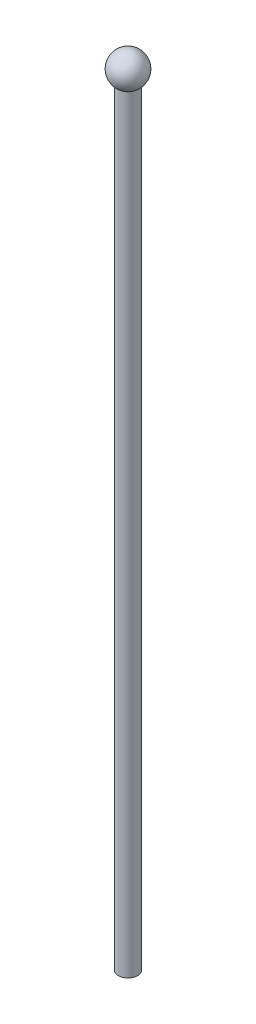
ISO-10303-21;
HEADER;
FILE_DESCRIPTION(('STEP AP214'),'2;1');
FILE_NAME('part.step','',(''),(''),'','','');
FILE_SCHEMA(('AUTOMOTIVE_DESIGN { 1 0 10303 214 1 1 1 1 }'));
ENDSEC;
DATA;
#1=APPLICATION_CONTEXT('core data for automotive mechanical design processes');
#2=APPLICATION_PROTOCOL_DEFINITION('international standard','automotive_design',2000,#1);
#3=PRODUCT_CONTEXT('',#1,'mechanical');
#4=PRODUCT('Part','Part','',(#3));
#5=PRODUCT_RELATED_PRODUCT_CATEGORY('part','',(#4));
#6=PRODUCT_DEFINITION_FORMATION('','',#4);
#7=PRODUCT_DEFINITION_CONTEXT('part definition',#1,'design');
#8=PRODUCT_DEFINITION('design','',#6,#7);
#9=PRODUCT_DEFINITION_SHAPE('','',#8);
#10=(LENGTH_UNIT() NAMED_UNIT(*) SI_UNIT(.MILLI.,.METRE.));
#11=(NAMED_UNIT(*) PLANE_ANGLE_UNIT() SI_UNIT($,.RADIAN.));
#12=(NAMED_UNIT(*) SI_UNIT($,.STERADIAN.) SOLID_ANGLE_UNIT());
#13=UNCERTAINTY_MEASURE_WITH_UNIT(LENGTH_MEASURE(1.E-05),#10,'distance_accuracy_value','');
#14=(GEOMETRIC_REPRESENTATION_CONTEXT(3) GLOBAL_UNCERTAINTY_ASSIGNED_CONTEXT((#13)) GLOBAL_UNIT_ASSIGNED_CONTEXT((#10,
#11,#12)) REPRESENTATION_CONTEXT('',''));
#15=CARTESIAN_POINT('',(0.,0.,0.));
#16=DIRECTION('',(0.,0.,1.));
#17=DIRECTION('',(1.,0.,0.));
#18=AXIS2_PLACEMENT_3D('',#15,#16,#17);
#19=CARTESIAN_POINT('',(0.,254.,0.));
#20=DIRECTION('',(0.,-1.,0.));
#21=DIRECTION('',(0.,0.,-1.));
#22=AXIS2_PLACEMENT_3D('',#19,#20,#21);
#23=CYLINDRICAL_SURFACE('',#22,3.175);
#24=CARTESIAN_POINT('',(0.,254.,0.));
#25=DIRECTION('',(0.,1.,0.));
#26=DIRECTION('',(0.,0.,1.));
#27=AXIS2_PLACEMENT_3D('',#24,#25,#26);
#28=CIRCLE('',#27,3.175);
#29=CARTESIAN_POINT('',(0.,254.,3.175));
#30=VERTEX_POINT('',#29);
#31=EDGE_CURVE('E10',#30,#30,#28,.T.);
#32=ORIENTED_EDGE('',*,*,#31,.F.);
#33=EDGE_LOOP('',(#32));
#34=FACE_BOUND('',#33,.T.);
#35=CARTESIAN_POINT('',(0.,0.,0.));
#36=DIRECTION('',(0.,1.,0.));
#37=DIRECTION('',(0.,0.,1.));
#38=AXIS2_PLACEMENT_3D('',#35,#36,#37);
#39=CIRCLE('',#38,3.175);
#40=CARTESIAN_POINT('',(0.,0.,3.175));
#41=VERTEX_POINT('',#40);
#42=EDGE_CURVE('E34',#41,#41,#39,.T.);
#43=ORIENTED_EDGE('',*,*,#42,.T.);
#44=EDGE_LOOP('',(#43));
#45=FACE_BOUND('',#44,.T.);
#46=ADVANCED_FACE('F31',(#34,#45),#23,.T.);
#47=CARTESIAN_POINT('',(0.,0.,0.));
#48=DIRECTION('',(0.,1.,0.));
#49=DIRECTION('',(0.,0.,1.));
#50=AXIS2_PLACEMENT_3D('',#47,#48,#49);
#51=PLANE('',#50);
#52=ORIENTED_EDGE('',*,*,#42,.F.);
#53=EDGE_LOOP('',(#52));
#54=FACE_BOUND('',#53,.T.);
#55=ADVANCED_FACE('F44',(#54),#51,.F.);
#56=CARTESIAN_POINT('',(0.,258.325806103082,0.));
#57=DIRECTION('',(0.,-1.,0.));
#58=DIRECTION('',(-1.,0.,0.));
#59=AXIS2_PLACEMENT_3D('',#56,#57,#58);
#60=SPHERICAL_SURFACE('',#59,5.36593174029099);
#61=ORIENTED_EDGE('',*,*,#31,.T.);
#62=EDGE_LOOP('',(#61));
#63=FACE_BOUND('',#62,.T.);
#64=ADVANCED_FACE('F46',(#63),#60,.T.);
#65=CLOSED_SHELL('',(#46,#55,#64));
#66=MANIFOLD_SOLID_BREP('B2',#65);
#67=ADVANCED_BREP_SHAPE_REPRESENTATION('',(#18,#66),#14);
#68=SHAPE_DEFINITION_REPRESENTATION(#9,#67);
ENDSEC;
END-ISO-10303-21;
